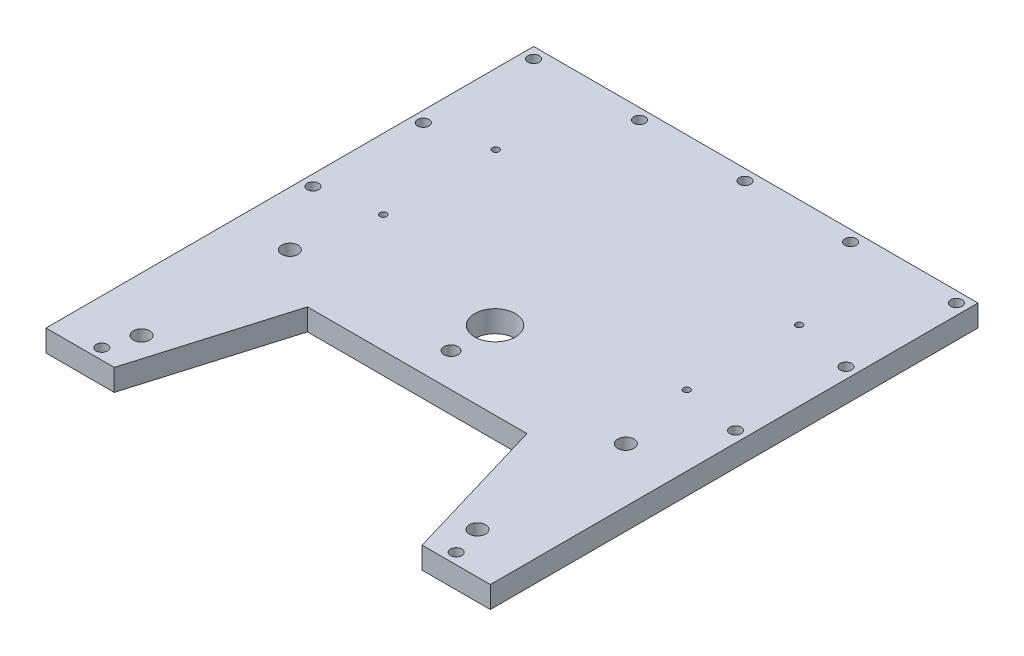
ISO-10303-21;
HEADER;
FILE_DESCRIPTION(('STEP AP214'),'2;1');
FILE_NAME('part.step','',(''),(''),'','','');
FILE_SCHEMA(('AUTOMOTIVE_DESIGN { 1 0 10303 214 1 1 1 1 }'));
ENDSEC;
DATA;
#1=APPLICATION_CONTEXT('core data for automotive mechanical design processes');
#2=APPLICATION_PROTOCOL_DEFINITION('international standard','automotive_design',2000,#1);
#3=PRODUCT_CONTEXT('',#1,'mechanical');
#4=PRODUCT('Part','Part','',(#3));
#5=PRODUCT_RELATED_PRODUCT_CATEGORY('part','',(#4));
#6=PRODUCT_DEFINITION_FORMATION('','',#4);
#7=PRODUCT_DEFINITION_CONTEXT('part definition',#1,'design');
#8=PRODUCT_DEFINITION('design','',#6,#7);
#9=PRODUCT_DEFINITION_SHAPE('','',#8);
#10=(LENGTH_UNIT() NAMED_UNIT(*) SI_UNIT(.MILLI.,.METRE.));
#11=(NAMED_UNIT(*) PLANE_ANGLE_UNIT() SI_UNIT($,.RADIAN.));
#12=(NAMED_UNIT(*) SI_UNIT($,.STERADIAN.) SOLID_ANGLE_UNIT());
#13=UNCERTAINTY_MEASURE_WITH_UNIT(LENGTH_MEASURE(1.E-05),#10,'distance_accuracy_value','');
#14=(GEOMETRIC_REPRESENTATION_CONTEXT(3) GLOBAL_UNCERTAINTY_ASSIGNED_CONTEXT((#13)) GLOBAL_UNIT_ASSIGNED_CONTEXT((#10,
#11,#12)) REPRESENTATION_CONTEXT('',''));
#15=CARTESIAN_POINT('',(0.,0.,0.));
#16=DIRECTION('',(0.,0.,1.));
#17=DIRECTION('',(1.,0.,0.));
#18=AXIS2_PLACEMENT_3D('',#15,#16,#17);
#19=CARTESIAN_POINT('',(0.,8.,0.));
#20=DIRECTION('',(0.,1.,0.));
#21=DIRECTION('',(0.,0.,1.));
#22=AXIS2_PLACEMENT_3D('',#19,#20,#21);
#23=PLANE('',#22);
#24=CARTESIAN_POINT('',(56.0000000000001,8.,-8.49999999999996));
#25=DIRECTION('',(0.,-1.,0.));
#26=DIRECTION('',(0.,0.,-1.));
#27=AXIS2_PLACEMENT_3D('',#24,#25,#26);
#28=CIRCLE('',#27,1.25000000000003);
#29=CARTESIAN_POINT('',(56.0000000000001,8.,-9.74999999999999));
#30=VERTEX_POINT('',#29);
#31=EDGE_CURVE('E230',#30,#30,#28,.T.);
#32=ORIENTED_EDGE('',*,*,#31,.T.);
#33=EDGE_LOOP('',(#32));
#34=FACE_BOUND('',#33,.T.);
#35=CARTESIAN_POINT('',(-56.0000000000001,8.,-50.));
#36=DIRECTION('',(0.,-1.,0.));
#37=DIRECTION('',(0.,0.,-1.));
#38=AXIS2_PLACEMENT_3D('',#35,#36,#37);
#39=CIRCLE('',#38,1.25);
#40=CARTESIAN_POINT('',(-56.0000000000001,8.,-51.25));
#41=VERTEX_POINT('',#40);
#42=EDGE_CURVE('E220',#41,#41,#39,.T.);
#43=ORIENTED_EDGE('',*,*,#42,.T.);
#44=EDGE_LOOP('',(#43));
#45=FACE_BOUND('',#44,.T.);
#46=CARTESIAN_POINT('',(-62.,8.,19.99));
#47=DIRECTION('',(0.,-1.,0.));
#48=DIRECTION('',(0.,0.,-1.));
#49=AXIS2_PLACEMENT_3D('',#46,#47,#48);
#50=CIRCLE('',#49,3.);
#51=CARTESIAN_POINT('',(-62.,8.,16.99));
#52=VERTEX_POINT('',#51);
#53=EDGE_CURVE('E194',#52,#52,#50,.T.);
#54=ORIENTED_EDGE('',*,*,#53,.T.);
#55=EDGE_LOOP('',(#54));
#56=FACE_BOUND('',#55,.T.);
#57=CARTESIAN_POINT('',(-62.,8.,74.7499999999999));
#58=DIRECTION('',(0.,-1.,0.));
#59=DIRECTION('',(0.,0.,-1.));
#60=AXIS2_PLACEMENT_3D('',#57,#58,#59);
#61=CIRCLE('',#60,3.);
#62=CARTESIAN_POINT('',(-62.,8.,71.7499999999999));
#63=VERTEX_POINT('',#62);
#64=EDGE_CURVE('E182',#63,#63,#61,.T.);
#65=ORIENTED_EDGE('',*,*,#64,.T.);
#66=EDGE_LOOP('',(#65));
#67=FACE_BOUND('',#66,.T.);
#68=CARTESIAN_POINT('',(65.4099999999999,8.,85.9999999999999));
#69=DIRECTION('',(0.,-1.,0.));
#70=DIRECTION('',(0.,0.,-1.));
#71=AXIS2_PLACEMENT_3D('',#68,#69,#70);
#72=CIRCLE('',#71,2.1);
#73=CARTESIAN_POINT('',(65.4099999999999,8.,83.8999999999999));
#74=VERTEX_POINT('',#73);
#75=EDGE_CURVE('E154',#74,#74,#72,.T.);
#76=ORIENTED_EDGE('',*,*,#75,.T.);
#77=EDGE_LOOP('',(#76));
#78=FACE_BOUND('',#77,.T.);
#79=DIRECTION('',(-1.,0.,0.));
#80=VECTOR('',#79,1.);
#81=CARTESIAN_POINT('',(0.,8.,35.));
#82=LINE('',#81,#80);
#83=CARTESIAN_POINT('',(40.5,8.,35.));
#84=VERTEX_POINT('',#83);
#85=CARTESIAN_POINT('',(-40.5,8.,35.));
#86=VERTEX_POINT('',#85);
#87=EDGE_CURVE('E145',#84,#86,#82,.T.);
#88=ORIENTED_EDGE('',*,*,#87,.F.);
#89=DIRECTION('',(-0.284414731086838,0.,-0.958701340742153));
#90=VECTOR('',#89,1.);
#91=CARTESIAN_POINT('',(27.6804771193105,8.,-8.21187487872877));
#92=LINE('',#91,#90);
#93=CARTESIAN_POINT('',(56.8166666666666,8.,89.9999999999999));
#94=VERTEX_POINT('',#93);
#95=EDGE_CURVE('E139',#94,#84,#92,.T.);
#96=ORIENTED_EDGE('',*,*,#95,.F.);
#97=DIRECTION('',(1.,0.,0.));
#98=VECTOR('',#97,1.);
#99=CARTESIAN_POINT('',(0.,8.,89.9999999999999));
#100=LINE('',#99,#98);
#101=CARTESIAN_POINT('',(82.,8.,89.9999999999999));
#102=VERTEX_POINT('',#101);
#103=EDGE_CURVE('E134',#94,#102,#100,.T.);
#104=ORIENTED_EDGE('',*,*,#103,.T.);
#105=DIRECTION('',(0.,0.,1.));
#106=VECTOR('',#105,1.);
#107=CARTESIAN_POINT('',(82.,8.,0.));
#108=LINE('',#107,#106);
#109=CARTESIAN_POINT('',(82.,8.,-90.0000000000001));
#110=VERTEX_POINT('',#109);
#111=EDGE_CURVE('E138',#110,#102,#108,.T.);
#112=ORIENTED_EDGE('',*,*,#111,.F.);
#113=DIRECTION('',(1.,0.,0.));
#114=VECTOR('',#113,1.);
#115=CARTESIAN_POINT('',(0.,8.,-90.0000000000001));
#116=LINE('',#115,#114);
#117=CARTESIAN_POINT('',(-82.,8.,-90.0000000000001));
#118=VERTEX_POINT('',#117);
#119=EDGE_CURVE('E119',#118,#110,#116,.T.);
#120=ORIENTED_EDGE('',*,*,#119,.F.);
#121=DIRECTION('',(0.,0.,1.));
#122=VECTOR('',#121,1.);
#123=CARTESIAN_POINT('',(-82.,8.,0.));
#124=LINE('',#123,#122);
#125=CARTESIAN_POINT('',(-82.,8.,89.9999999999999));
#126=VERTEX_POINT('',#125);
#127=EDGE_CURVE('E111',#118,#126,#124,.T.);
#128=ORIENTED_EDGE('',*,*,#127,.T.);
#129=CARTESIAN_POINT('',(-56.8166666666667,8.,89.9999999999999));
#130=VERTEX_POINT('',#129);
#131=EDGE_CURVE('E116',#126,#130,#100,.T.);
#132=ORIENTED_EDGE('',*,*,#131,.T.);
#133=DIRECTION('',(-0.284414731086839,0.,0.958701340742153));
#134=VECTOR('',#133,1.);
#135=CARTESIAN_POINT('',(-27.6804771193105,8.,-8.21187487872878));
#136=LINE('',#135,#134);
#137=EDGE_CURVE('E132',#86,#130,#136,.T.);
#138=ORIENTED_EDGE('',*,*,#137,.F.);
#139=EDGE_LOOP('',(#88,#96,#104,#112,#120,#128,#132,#138));
#140=FACE_BOUND('',#139,.T.);
#141=CARTESIAN_POINT('',(-78.,8.,-86.));
#142=DIRECTION('',(0.,1.,0.));
#143=DIRECTION('',(0.,0.,1.));
#144=AXIS2_PLACEMENT_3D('',#141,#142,#143);
#145=CIRCLE('',#144,2.1);
#146=CARTESIAN_POINT('',(-78.,8.,-83.9));
#147=VERTEX_POINT('',#146);
#148=EDGE_CURVE('E150',#147,#147,#145,.T.);
#149=ORIENTED_EDGE('',*,*,#148,.F.);
#150=EDGE_LOOP('',(#149));
#151=FACE_BOUND('',#150,.T.);
#152=CARTESIAN_POINT('',(-65.41,8.,85.9999999999999));
#153=DIRECTION('',(0.,1.,0.));
#154=DIRECTION('',(0.,0.,1.));
#155=AXIS2_PLACEMENT_3D('',#152,#153,#154);
#156=CIRCLE('',#155,2.1);
#157=CARTESIAN_POINT('',(-65.41,8.,88.0999999999999));
#158=VERTEX_POINT('',#157);
#159=EDGE_CURVE('E179',#158,#158,#156,.T.);
#160=ORIENTED_EDGE('',*,*,#159,.F.);
#161=EDGE_LOOP('',(#160));
#162=FACE_BOUND('',#161,.T.);
#163=CARTESIAN_POINT('',(78.,8.,-4.50000000000008));
#164=DIRECTION('',(0.,-1.,0.));
#165=DIRECTION('',(0.,0.,-1.));
#166=AXIS2_PLACEMENT_3D('',#163,#164,#165);
#167=CIRCLE('',#166,2.1);
#168=CARTESIAN_POINT('',(78.,8.,-6.60000000000008));
#169=VERTEX_POINT('',#168);
#170=EDGE_CURVE('E171',#169,#169,#167,.T.);
#171=ORIENTED_EDGE('',*,*,#170,.T.);
#172=EDGE_LOOP('',(#171));
#173=FACE_BOUND('',#172,.T.);
#174=CARTESIAN_POINT('',(78.,8.,-86.0000000000006));
#175=DIRECTION('',(0.,1.,0.));
#176=DIRECTION('',(0.,0.,1.));
#177=AXIS2_PLACEMENT_3D('',#174,#175,#176);
#178=CIRCLE('',#177,2.1);
#179=CARTESIAN_POINT('',(78.,8.,-83.9000000000006));
#180=VERTEX_POINT('',#179);
#181=EDGE_CURVE('E162',#180,#180,#178,.T.);
#182=ORIENTED_EDGE('',*,*,#181,.F.);
#183=EDGE_LOOP('',(#182));
#184=FACE_BOUND('',#183,.T.);
#185=CARTESIAN_POINT('',(39.,8.,-86.0000000000005));
#186=DIRECTION('',(0.,1.,0.));
#187=DIRECTION('',(0.,0.,1.));
#188=AXIS2_PLACEMENT_3D('',#185,#186,#187);
#189=CIRCLE('',#188,2.1);
#190=CARTESIAN_POINT('',(39.,8.,-83.9000000000004));
#191=VERTEX_POINT('',#190);
#192=EDGE_CURVE('E158',#191,#191,#189,.T.);
#193=ORIENTED_EDGE('',*,*,#192,.F.);
#194=EDGE_LOOP('',(#193));
#195=FACE_BOUND('',#194,.T.);
#196=CARTESIAN_POINT('',(-78.,8.,-45.25));
#197=DIRECTION('',(0.,1.,0.));
#198=DIRECTION('',(0.,0.,1.));
#199=AXIS2_PLACEMENT_3D('',#196,#197,#198);
#200=CIRCLE('',#199,2.09999999999999);
#201=CARTESIAN_POINT('',(-78.,8.,-43.15));
#202=VERTEX_POINT('',#201);
#203=EDGE_CURVE('E155',#202,#202,#200,.T.);
#204=ORIENTED_EDGE('',*,*,#203,.F.);
#205=EDGE_LOOP('',(#204));
#206=FACE_BOUND('',#205,.T.);
#207=CARTESIAN_POINT('',(-39.,8.,-86.0000000000002));
#208=DIRECTION('',(0.,1.,0.));
#209=DIRECTION('',(0.,0.,1.));
#210=AXIS2_PLACEMENT_3D('',#207,#208,#209);
#211=CIRCLE('',#210,2.1);
#212=CARTESIAN_POINT('',(-39.,8.,-83.9000000000002));
#213=VERTEX_POINT('',#212);
#214=EDGE_CURVE('E159',#213,#213,#211,.T.);
#215=ORIENTED_EDGE('',*,*,#214,.F.);
#216=EDGE_LOOP('',(#215));
#217=FACE_BOUND('',#216,.T.);
#218=CARTESIAN_POINT('',(0.,8.,-86.0000000000003));
#219=DIRECTION('',(0.,1.,0.));
#220=DIRECTION('',(0.,0.,1.));
#221=AXIS2_PLACEMENT_3D('',#218,#219,#220);
#222=CIRCLE('',#221,2.1);
#223=CARTESIAN_POINT('',(0.,8.,-83.9000000000003));
#224=VERTEX_POINT('',#223);
#225=EDGE_CURVE('E174',#224,#224,#222,.T.);
#226=ORIENTED_EDGE('',*,*,#225,.F.);
#227=EDGE_LOOP('',(#226));
#228=FACE_BOUND('',#227,.T.);
#229=CARTESIAN_POINT('',(-78.,8.,-4.50000000000005));
#230=DIRECTION('',(0.,1.,0.));
#231=DIRECTION('',(0.,0.,1.));
#232=AXIS2_PLACEMENT_3D('',#229,#230,#231);
#233=CIRCLE('',#232,2.1);
#234=CARTESIAN_POINT('',(-78.,8.,-2.40000000000005));
#235=VERTEX_POINT('',#234);
#236=EDGE_CURVE('E170',#235,#235,#233,.T.);
#237=ORIENTED_EDGE('',*,*,#236,.F.);
#238=EDGE_LOOP('',(#237));
#239=FACE_BOUND('',#238,.T.);
#240=CARTESIAN_POINT('',(78.,8.,-45.2500000000001));
#241=DIRECTION('',(0.,-1.,0.));
#242=DIRECTION('',(0.,0.,-1.));
#243=AXIS2_PLACEMENT_3D('',#240,#241,#242);
#244=CIRCLE('',#243,2.09999999999999);
#245=CARTESIAN_POINT('',(78.,8.,-47.3500000000001));
#246=VERTEX_POINT('',#245);
#247=EDGE_CURVE('E167',#246,#246,#244,.T.);
#248=ORIENTED_EDGE('',*,*,#247,.T.);
#249=EDGE_LOOP('',(#248));
#250=FACE_BOUND('',#249,.T.);
#251=CARTESIAN_POINT('',(0.,8.,22.5));
#252=DIRECTION('',(0.,1.,0.));
#253=DIRECTION('',(0.,0.,1.));
#254=AXIS2_PLACEMENT_3D('',#251,#252,#253);
#255=CIRCLE('',#254,2.6);
#256=CARTESIAN_POINT('',(0.,8.,25.1));
#257=VERTEX_POINT('',#256);
#258=EDGE_CURVE('E210',#257,#257,#255,.T.);
#259=ORIENTED_EDGE('',*,*,#258,.F.);
#260=EDGE_LOOP('',(#259));
#261=FACE_BOUND('',#260,.T.);
#262=CARTESIAN_POINT('',(62.,8.,74.7499999999999));
#263=DIRECTION('',(0.,1.,0.));
#264=DIRECTION('',(0.,0.,1.));
#265=AXIS2_PLACEMENT_3D('',#262,#263,#264);
#266=CIRCLE('',#265,3.00000000000001);
#267=CARTESIAN_POINT('',(62.,8.,77.7499999999999));
#268=VERTEX_POINT('',#267);
#269=EDGE_CURVE('E191',#268,#268,#266,.T.);
#270=ORIENTED_EDGE('',*,*,#269,.F.);
#271=EDGE_LOOP('',(#270));
#272=FACE_BOUND('',#271,.T.);
#273=CARTESIAN_POINT('',(62.,8.,19.9899999999999));
#274=DIRECTION('',(0.,1.,0.));
#275=DIRECTION('',(0.,0.,1.));
#276=AXIS2_PLACEMENT_3D('',#273,#274,#275);
#277=CIRCLE('',#276,3.00000000000001);
#278=CARTESIAN_POINT('',(62.,8.,22.99));
#279=VERTEX_POINT('',#278);
#280=EDGE_CURVE('E198',#279,#279,#277,.T.);
#281=ORIENTED_EDGE('',*,*,#280,.F.);
#282=EDGE_LOOP('',(#281));
#283=FACE_BOUND('',#282,.T.);
#284=CARTESIAN_POINT('',(0.,8.,6.24999999999995));
#285=DIRECTION('',(0.,1.,0.));
#286=DIRECTION('',(0.,0.,1.));
#287=AXIS2_PLACEMENT_3D('',#284,#285,#286);
#288=CIRCLE('',#287,7.5);
#289=CARTESIAN_POINT('',(0.,8.,13.75));
#290=VERTEX_POINT('',#289);
#291=EDGE_CURVE('E203',#290,#290,#288,.T.);
#292=ORIENTED_EDGE('',*,*,#291,.F.);
#293=EDGE_LOOP('',(#292));
#294=FACE_BOUND('',#293,.T.);
#295=CARTESIAN_POINT('',(-56.0000000000001,8.,-8.49999999999995));
#296=DIRECTION('',(0.,1.,0.));
#297=DIRECTION('',(0.,0.,1.));
#298=AXIS2_PLACEMENT_3D('',#295,#296,#297);
#299=CIRCLE('',#298,1.25000000000006);
#300=CARTESIAN_POINT('',(-56.0000000000001,8.,-7.24999999999989));
#301=VERTEX_POINT('',#300);
#302=EDGE_CURVE('E224',#301,#301,#299,.T.);
#303=ORIENTED_EDGE('',*,*,#302,.F.);
#304=EDGE_LOOP('',(#303));
#305=FACE_BOUND('',#304,.T.);
#306=CARTESIAN_POINT('',(56.0000000000001,8.,-50.0000000000001));
#307=DIRECTION('',(0.,1.,0.));
#308=DIRECTION('',(0.,0.,1.));
#309=AXIS2_PLACEMENT_3D('',#306,#307,#308);
#310=CIRCLE('',#309,1.25);
#311=CARTESIAN_POINT('',(56.0000000000001,8.,-48.7500000000001));
#312=VERTEX_POINT('',#311);
#313=EDGE_CURVE('E227',#312,#312,#310,.T.);
#314=ORIENTED_EDGE('',*,*,#313,.F.);
#315=EDGE_LOOP('',(#314));
#316=FACE_BOUND('',#315,.T.);
#317=ADVANCED_FACE('F41',(#34,#45,#56,#67,#78,#140,#151,#162,#173,#184,#195,#206,#217,#228,#239,
#250,#261,#272,#283,#294,#305,#316),#23,.T.);
#318=CARTESIAN_POINT('',(0.,0.,0.));
#319=DIRECTION('',(0.,1.,0.));
#320=DIRECTION('',(0.,0.,1.));
#321=AXIS2_PLACEMENT_3D('',#318,#319,#320);
#322=PLANE('',#321);
#323=CARTESIAN_POINT('',(-56.0000000000001,0.,-8.49999999999995));
#324=DIRECTION('',(0.,1.,0.));
#325=DIRECTION('',(0.,0.,1.));
#326=AXIS2_PLACEMENT_3D('',#323,#324,#325);
#327=CIRCLE('',#326,1.25000000000006);
#328=CARTESIAN_POINT('',(-56.0000000000001,0.,-7.24999999999989));
#329=VERTEX_POINT('',#328);
#330=EDGE_CURVE('E239',#329,#329,#327,.F.);
#331=ORIENTED_EDGE('',*,*,#330,.F.);
#332=EDGE_LOOP('',(#331));
#333=FACE_BOUND('',#332,.T.);
#334=CARTESIAN_POINT('',(-56.0000000000001,0.,-50.));
#335=DIRECTION('',(0.,1.,0.));
#336=DIRECTION('',(0.,0.,1.));
#337=AXIS2_PLACEMENT_3D('',#334,#335,#336);
#338=CIRCLE('',#337,1.25);
#339=CARTESIAN_POINT('',(-56.0000000000001,0.,-48.75));
#340=VERTEX_POINT('',#339);
#341=EDGE_CURVE('E221',#340,#340,#338,.T.);
#342=ORIENTED_EDGE('',*,*,#341,.T.);
#343=EDGE_LOOP('',(#342));
#344=FACE_BOUND('',#343,.T.);
#345=CARTESIAN_POINT('',(62.,0.,19.9899999999999));
#346=DIRECTION('',(0.,1.,0.));
#347=DIRECTION('',(0.,0.,1.));
#348=AXIS2_PLACEMENT_3D('',#345,#346,#347);
#349=CIRCLE('',#348,3.00000000000001);
#350=CARTESIAN_POINT('',(62.,0.,22.99));
#351=VERTEX_POINT('',#350);
#352=EDGE_CURVE('E206',#351,#351,#349,.F.);
#353=ORIENTED_EDGE('',*,*,#352,.F.);
#354=EDGE_LOOP('',(#353));
#355=FACE_BOUND('',#354,.T.);
#356=CARTESIAN_POINT('',(0.,0.,22.5));
#357=DIRECTION('',(0.,1.,0.));
#358=DIRECTION('',(0.,0.,1.));
#359=AXIS2_PLACEMENT_3D('',#356,#357,#358);
#360=CIRCLE('',#359,2.6);
#361=CARTESIAN_POINT('',(0.,0.,25.1));
#362=VERTEX_POINT('',#361);
#363=EDGE_CURVE('E217',#362,#362,#360,.F.);
#364=ORIENTED_EDGE('',*,*,#363,.F.);
#365=EDGE_LOOP('',(#364));
#366=FACE_BOUND('',#365,.T.);
#367=CARTESIAN_POINT('',(-62.,0.,74.7499999999999));
#368=DIRECTION('',(0.,1.,0.));
#369=DIRECTION('',(0.,0.,1.));
#370=AXIS2_PLACEMENT_3D('',#367,#368,#369);
#371=CIRCLE('',#370,3.);
#372=CARTESIAN_POINT('',(-62.,0.,77.7499999999999));
#373=VERTEX_POINT('',#372);
#374=EDGE_CURVE('E185',#373,#373,#371,.T.);
#375=ORIENTED_EDGE('',*,*,#374,.T.);
#376=EDGE_LOOP('',(#375));
#377=FACE_BOUND('',#376,.T.);
#378=CARTESIAN_POINT('',(-78.,0.,-4.50000000000005));
#379=DIRECTION('',(0.,1.,0.));
#380=DIRECTION('',(0.,0.,1.));
#381=AXIS2_PLACEMENT_3D('',#378,#379,#380);
#382=CIRCLE('',#381,2.1);
#383=CARTESIAN_POINT('',(-78.,0.,-2.40000000000005));
#384=VERTEX_POINT('',#383);
#385=EDGE_CURVE('E262',#384,#384,#382,.T.);
#386=ORIENTED_EDGE('',*,*,#385,.T.);
#387=EDGE_LOOP('',(#386));
#388=FACE_BOUND('',#387,.T.);
#389=CARTESIAN_POINT('',(0.,0.,-86.0000000000003));
#390=DIRECTION('',(0.,1.,0.));
#391=DIRECTION('',(0.,0.,1.));
#392=AXIS2_PLACEMENT_3D('',#389,#390,#391);
#393=CIRCLE('',#392,2.1);
#394=CARTESIAN_POINT('',(0.,0.,-83.9000000000003));
#395=VERTEX_POINT('',#394);
#396=EDGE_CURVE('E266',#395,#395,#393,.T.);
#397=ORIENTED_EDGE('',*,*,#396,.T.);
#398=EDGE_LOOP('',(#397));
#399=FACE_BOUND('',#398,.T.);
#400=CARTESIAN_POINT('',(-39.,0.,-86.0000000000002));
#401=DIRECTION('',(0.,1.,0.));
#402=DIRECTION('',(0.,0.,1.));
#403=AXIS2_PLACEMENT_3D('',#400,#401,#402);
#404=CIRCLE('',#403,2.1);
#405=CARTESIAN_POINT('',(-39.,0.,-83.9000000000002));
#406=VERTEX_POINT('',#405);
#407=EDGE_CURVE('E270',#406,#406,#404,.T.);
#408=ORIENTED_EDGE('',*,*,#407,.T.);
#409=EDGE_LOOP('',(#408));
#410=FACE_BOUND('',#409,.T.);
#411=CARTESIAN_POINT('',(-78.,0.,-45.25));
#412=DIRECTION('',(0.,1.,0.));
#413=DIRECTION('',(0.,0.,1.));
#414=AXIS2_PLACEMENT_3D('',#411,#412,#413);
#415=CIRCLE('',#414,2.09999999999999);
#416=CARTESIAN_POINT('',(-78.,0.,-43.15));
#417=VERTEX_POINT('',#416);
#418=EDGE_CURVE('E274',#417,#417,#415,.T.);
#419=ORIENTED_EDGE('',*,*,#418,.T.);
#420=EDGE_LOOP('',(#419));
#421=FACE_BOUND('',#420,.T.);
#422=CARTESIAN_POINT('',(39.,0.,-86.0000000000005));
#423=DIRECTION('',(0.,1.,0.));
#424=DIRECTION('',(0.,0.,1.));
#425=AXIS2_PLACEMENT_3D('',#422,#423,#424);
#426=CIRCLE('',#425,2.1);
#427=CARTESIAN_POINT('',(39.,0.,-83.9000000000004));
#428=VERTEX_POINT('',#427);
#429=EDGE_CURVE('E278',#428,#428,#426,.T.);
#430=ORIENTED_EDGE('',*,*,#429,.T.);
#431=EDGE_LOOP('',(#430));
#432=FACE_BOUND('',#431,.T.);
#433=CARTESIAN_POINT('',(78.,0.,-86.0000000000006));
#434=DIRECTION('',(0.,1.,0.));
#435=DIRECTION('',(0.,0.,1.));
#436=AXIS2_PLACEMENT_3D('',#433,#434,#435);
#437=CIRCLE('',#436,2.1);
#438=CARTESIAN_POINT('',(78.,0.,-83.9000000000006));
#439=VERTEX_POINT('',#438);
#440=EDGE_CURVE('E282',#439,#439,#437,.T.);
#441=ORIENTED_EDGE('',*,*,#440,.T.);
#442=EDGE_LOOP('',(#441));
#443=FACE_BOUND('',#442,.T.);
#444=CARTESIAN_POINT('',(-65.41,0.,85.9999999999999));
#445=DIRECTION('',(0.,1.,0.));
#446=DIRECTION('',(0.,0.,1.));
#447=AXIS2_PLACEMENT_3D('',#444,#445,#446);
#448=CIRCLE('',#447,2.1);
#449=CARTESIAN_POINT('',(-65.41,0.,88.0999999999999));
#450=VERTEX_POINT('',#449);
#451=EDGE_CURVE('E286',#450,#450,#448,.T.);
#452=ORIENTED_EDGE('',*,*,#451,.T.);
#453=EDGE_LOOP('',(#452));
#454=FACE_BOUND('',#453,.T.);
#455=CARTESIAN_POINT('',(-78.,0.,-86.));
#456=DIRECTION('',(0.,1.,0.));
#457=DIRECTION('',(0.,0.,1.));
#458=AXIS2_PLACEMENT_3D('',#455,#456,#457);
#459=CIRCLE('',#458,2.1);
#460=CARTESIAN_POINT('',(-78.,0.,-83.9));
#461=VERTEX_POINT('',#460);
#462=EDGE_CURVE('E153',#461,#461,#459,.T.);
#463=ORIENTED_EDGE('',*,*,#462,.T.);
#464=EDGE_LOOP('',(#463));
#465=FACE_BOUND('',#464,.T.);
#466=DIRECTION('',(-1.,0.,0.));
#467=VECTOR('',#466,1.);
#468=CARTESIAN_POINT('',(0.,0.,35.));
#469=LINE('',#468,#467);
#470=CARTESIAN_POINT('',(40.5,0.,35.));
#471=VERTEX_POINT('',#470);
#472=CARTESIAN_POINT('',(-40.5,0.,35.));
#473=VERTEX_POINT('',#472);
#474=EDGE_CURVE('E293',#471,#473,#469,.T.);
#475=ORIENTED_EDGE('',*,*,#474,.T.);
#476=DIRECTION('',(-0.284414731086839,0.,0.958701340742153));
#477=VECTOR('',#476,1.);
#478=CARTESIAN_POINT('',(-27.6804771193105,0.,-8.21187487872878));
#479=LINE('',#478,#477);
#480=CARTESIAN_POINT('',(-56.8166666666667,0.,89.9999999999999));
#481=VERTEX_POINT('',#480);
#482=EDGE_CURVE('E147',#473,#481,#479,.T.);
#483=ORIENTED_EDGE('',*,*,#482,.T.);
#484=DIRECTION('',(1.,0.,0.));
#485=VECTOR('',#484,1.);
#486=CARTESIAN_POINT('',(0.,0.,89.9999999999999));
#487=LINE('',#486,#485);
#488=CARTESIAN_POINT('',(-82.,0.,89.9999999999999));
#489=VERTEX_POINT('',#488);
#490=EDGE_CURVE('E366',#489,#481,#487,.T.);
#491=ORIENTED_EDGE('',*,*,#490,.F.);
#492=DIRECTION('',(0.,0.,1.));
#493=VECTOR('',#492,1.);
#494=CARTESIAN_POINT('',(-82.,0.,0.));
#495=LINE('',#494,#493);
#496=CARTESIAN_POINT('',(-82.,0.,-90.0000000000001));
#497=VERTEX_POINT('',#496);
#498=EDGE_CURVE('E126',#497,#489,#495,.T.);
#499=ORIENTED_EDGE('',*,*,#498,.F.);
#500=DIRECTION('',(1.,0.,0.));
#501=VECTOR('',#500,1.);
#502=CARTESIAN_POINT('',(0.,0.,-90.0000000000001));
#503=LINE('',#502,#501);
#504=CARTESIAN_POINT('',(82.,0.,-90.0000000000001));
#505=VERTEX_POINT('',#504);
#506=EDGE_CURVE('E371',#497,#505,#503,.T.);
#507=ORIENTED_EDGE('',*,*,#506,.T.);
#508=DIRECTION('',(0.,0.,1.));
#509=VECTOR('',#508,1.);
#510=CARTESIAN_POINT('',(82.,0.,0.));
#511=LINE('',#510,#509);
#512=CARTESIAN_POINT('',(82.,0.,89.9999999999999));
#513=VERTEX_POINT('',#512);
#514=EDGE_CURVE('E364',#505,#513,#511,.T.);
#515=ORIENTED_EDGE('',*,*,#514,.T.);
#516=CARTESIAN_POINT('',(56.8166666666666,0.,89.9999999999999));
#517=VERTEX_POINT('',#516);
#518=EDGE_CURVE('E361',#517,#513,#487,.T.);
#519=ORIENTED_EDGE('',*,*,#518,.F.);
#520=DIRECTION('',(-0.284414731086838,0.,-0.958701340742153));
#521=VECTOR('',#520,1.);
#522=CARTESIAN_POINT('',(27.6804771193105,0.,-8.21187487872877));
#523=LINE('',#522,#521);
#524=EDGE_CURVE('E359',#517,#471,#523,.T.);
#525=ORIENTED_EDGE('',*,*,#524,.T.);
#526=EDGE_LOOP('',(#475,#483,#491,#499,#507,#515,#519,#525));
#527=FACE_BOUND('',#526,.T.);
#528=CARTESIAN_POINT('',(78.,0.,-4.50000000000008));
#529=DIRECTION('',(0.,1.,0.));
#530=DIRECTION('',(0.,0.,1.));
#531=AXIS2_PLACEMENT_3D('',#528,#529,#530);
#532=CIRCLE('',#531,2.1);
#533=CARTESIAN_POINT('',(78.,0.,-2.40000000000008));
#534=VERTEX_POINT('',#533);
#535=EDGE_CURVE('E297',#534,#534,#532,.F.);
#536=ORIENTED_EDGE('',*,*,#535,.F.);
#537=EDGE_LOOP('',(#536));
#538=FACE_BOUND('',#537,.T.);
#539=CARTESIAN_POINT('',(65.4099999999999,0.,85.9999999999999));
#540=DIRECTION('',(0.,1.,0.));
#541=DIRECTION('',(0.,0.,1.));
#542=AXIS2_PLACEMENT_3D('',#539,#540,#541);
#543=CIRCLE('',#542,2.1);
#544=CARTESIAN_POINT('',(65.4099999999999,0.,88.0999999999999));
#545=VERTEX_POINT('',#544);
#546=EDGE_CURVE('E301',#545,#545,#543,.F.);
#547=ORIENTED_EDGE('',*,*,#546,.F.);
#548=EDGE_LOOP('',(#547));
#549=FACE_BOUND('',#548,.T.);
#550=CARTESIAN_POINT('',(78.,0.,-45.2500000000001));
#551=DIRECTION('',(0.,1.,0.));
#552=DIRECTION('',(0.,0.,1.));
#553=AXIS2_PLACEMENT_3D('',#550,#551,#552);
#554=CIRCLE('',#553,2.09999999999999);
#555=CARTESIAN_POINT('',(78.,0.,-43.1500000000001));
#556=VERTEX_POINT('',#555);
#557=EDGE_CURVE('E45',#556,#556,#554,.F.);
#558=ORIENTED_EDGE('',*,*,#557,.F.);
#559=EDGE_LOOP('',(#558));
#560=FACE_BOUND('',#559,.T.);
#561=CARTESIAN_POINT('',(-62.,0.,19.99));
#562=DIRECTION('',(0.,1.,0.));
#563=DIRECTION('',(0.,0.,1.));
#564=AXIS2_PLACEMENT_3D('',#561,#562,#563);
#565=CIRCLE('',#564,3.);
#566=CARTESIAN_POINT('',(-62.,0.,22.99));
#567=VERTEX_POINT('',#566);
#568=EDGE_CURVE('E188',#567,#567,#565,.T.);
#569=ORIENTED_EDGE('',*,*,#568,.T.);
#570=EDGE_LOOP('',(#569));
#571=FACE_BOUND('',#570,.T.);
#572=CARTESIAN_POINT('',(62.,0.,74.7499999999999));
#573=DIRECTION('',(0.,1.,0.));
#574=DIRECTION('',(0.,0.,1.));
#575=AXIS2_PLACEMENT_3D('',#572,#573,#574);
#576=CIRCLE('',#575,3.00000000000001);
#577=CARTESIAN_POINT('',(62.,0.,77.7499999999999));
#578=VERTEX_POINT('',#577);
#579=EDGE_CURVE('E195',#578,#578,#576,.F.);
#580=ORIENTED_EDGE('',*,*,#579,.F.);
#581=EDGE_LOOP('',(#580));
#582=FACE_BOUND('',#581,.T.);
#583=CARTESIAN_POINT('',(0.,0.,6.24999999999995));
#584=DIRECTION('',(0.,1.,0.));
#585=DIRECTION('',(0.,0.,1.));
#586=AXIS2_PLACEMENT_3D('',#583,#584,#585);
#587=CIRCLE('',#586,7.5);
#588=CARTESIAN_POINT('',(0.,0.,13.75));
#589=VERTEX_POINT('',#588);
#590=EDGE_CURVE('E207',#589,#589,#587,.F.);
#591=ORIENTED_EDGE('',*,*,#590,.F.);
#592=EDGE_LOOP('',(#591));
#593=FACE_BOUND('',#592,.T.);
#594=CARTESIAN_POINT('',(56.0000000000001,0.,-8.49999999999996));
#595=DIRECTION('',(0.,1.,0.));
#596=DIRECTION('',(0.,0.,1.));
#597=AXIS2_PLACEMENT_3D('',#594,#595,#596);
#598=CIRCLE('',#597,1.25000000000003);
#599=CARTESIAN_POINT('',(56.0000000000001,0.,-7.24999999999994));
#600=VERTEX_POINT('',#599);
#601=EDGE_CURVE('E236',#600,#600,#598,.T.);
#602=ORIENTED_EDGE('',*,*,#601,.T.);
#603=EDGE_LOOP('',(#602));
#604=FACE_BOUND('',#603,.T.);
#605=CARTESIAN_POINT('',(56.0000000000001,0.,-50.0000000000001));
#606=DIRECTION('',(0.,1.,0.));
#607=DIRECTION('',(0.,0.,1.));
#608=AXIS2_PLACEMENT_3D('',#605,#606,#607);
#609=CIRCLE('',#608,1.25);
#610=CARTESIAN_POINT('',(56.0000000000001,0.,-48.7500000000001));
#611=VERTEX_POINT('',#610);
#612=EDGE_CURVE('E231',#611,#611,#609,.F.);
#613=ORIENTED_EDGE('',*,*,#612,.F.);
#614=EDGE_LOOP('',(#613));
#615=FACE_BOUND('',#614,.T.);
#616=ADVANCED_FACE('F247',(#333,#344,#355,#366,#377,#388,#399,#410,#421,#432,#443,#454,#465,
#527,#538,#549,#560,#571,#582,#593,#604,#615),#322,.F.);
#617=CARTESIAN_POINT('',(0.,8.,35.));
#618=DIRECTION('',(0.,0.,1.));
#619=DIRECTION('',(1.,0.,0.));
#620=AXIS2_PLACEMENT_3D('',#617,#618,#619);
#621=PLANE('',#620);
#622=ORIENTED_EDGE('',*,*,#474,.F.);
#623=DIRECTION('',(0.,-1.,0.));
#624=VECTOR('',#623,1.);
#625=CARTESIAN_POINT('',(40.5,8.,35.));
#626=LINE('',#625,#624);
#627=EDGE_CURVE('E11',#84,#471,#626,.T.);
#628=ORIENTED_EDGE('',*,*,#627,.F.);
#629=ORIENTED_EDGE('',*,*,#87,.T.);
#630=DIRECTION('',(0.,-1.,0.));
#631=VECTOR('',#630,1.);
#632=CARTESIAN_POINT('',(-40.5,8.,35.));
#633=LINE('',#632,#631);
#634=EDGE_CURVE('E60',#86,#473,#633,.T.);
#635=ORIENTED_EDGE('',*,*,#634,.T.);
#636=EDGE_LOOP('',(#622,#628,#629,#635));
#637=FACE_BOUND('',#636,.T.);
#638=ADVANCED_FACE('F43',(#637),#621,.T.);
#639=CARTESIAN_POINT('',(27.6804771193105,8.,-8.21187487872877));
#640=DIRECTION('',(-0.958701340742153,0.,0.284414731086838));
#641=DIRECTION('',(0.284414731086838,0.,0.958701340742153));
#642=AXIS2_PLACEMENT_3D('',#639,#640,#641);
#643=PLANE('',#642);
#644=ORIENTED_EDGE('',*,*,#524,.F.);
#645=DIRECTION('',(0.,-1.,0.));
#646=VECTOR('',#645,1.);
#647=CARTESIAN_POINT('',(56.8166666666666,8.,89.9999999999999));
#648=LINE('',#647,#646);
#649=EDGE_CURVE('E51',#94,#517,#648,.T.);
#650=ORIENTED_EDGE('',*,*,#649,.F.);
#651=ORIENTED_EDGE('',*,*,#95,.T.);
#652=ORIENTED_EDGE('',*,*,#627,.T.);
#653=EDGE_LOOP('',(#644,#650,#651,#652));
#654=FACE_BOUND('',#653,.T.);
#655=ADVANCED_FACE('F351',(#654),#643,.T.);
#656=CARTESIAN_POINT('',(0.,8.,89.9999999999999));
#657=DIRECTION('',(0.,0.,-1.));
#658=DIRECTION('',(-1.,0.,0.));
#659=AXIS2_PLACEMENT_3D('',#656,#657,#658);
#660=PLANE('',#659);
#661=ORIENTED_EDGE('',*,*,#518,.T.);
#662=DIRECTION('',(0.,-1.,0.));
#663=VECTOR('',#662,1.);
#664=CARTESIAN_POINT('',(82.,8.,89.9999999999999));
#665=LINE('',#664,#663);
#666=EDGE_CURVE('E381',#102,#513,#665,.T.);
#667=ORIENTED_EDGE('',*,*,#666,.F.);
#668=ORIENTED_EDGE('',*,*,#103,.F.);
#669=ORIENTED_EDGE('',*,*,#649,.T.);
#670=EDGE_LOOP('',(#661,#667,#668,#669));
#671=FACE_BOUND('',#670,.T.);
#672=ADVANCED_FACE('F341',(#671),#660,.F.);
#673=CARTESIAN_POINT('',(82.,8.,0.));
#674=DIRECTION('',(1.,0.,0.));
#675=DIRECTION('',(0.,0.,-1.));
#676=AXIS2_PLACEMENT_3D('',#673,#674,#675);
#677=PLANE('',#676);
#678=ORIENTED_EDGE('',*,*,#514,.F.);
#679=DIRECTION('',(0.,-1.,0.));
#680=VECTOR('',#679,1.);
#681=CARTESIAN_POINT('',(82.,8.,-90.0000000000001));
#682=LINE('',#681,#680);
#683=EDGE_CURVE('E379',#110,#505,#682,.T.);
#684=ORIENTED_EDGE('',*,*,#683,.F.);
#685=ORIENTED_EDGE('',*,*,#111,.T.);
#686=ORIENTED_EDGE('',*,*,#666,.T.);
#687=EDGE_LOOP('',(#678,#684,#685,#686));
#688=FACE_BOUND('',#687,.T.);
#689=ADVANCED_FACE('F347',(#688),#677,.T.);
#690=CARTESIAN_POINT('',(0.,8.,-90.0000000000001));
#691=DIRECTION('',(0.,0.,-1.));
#692=DIRECTION('',(-1.,0.,0.));
#693=AXIS2_PLACEMENT_3D('',#690,#691,#692);
#694=PLANE('',#693);
#695=ORIENTED_EDGE('',*,*,#506,.F.);
#696=DIRECTION('',(0.,-1.,0.));
#697=VECTOR('',#696,1.);
#698=CARTESIAN_POINT('',(-82.,8.,-90.0000000000001));
#699=LINE('',#698,#697);
#700=EDGE_CURVE('E129',#118,#497,#699,.T.);
#701=ORIENTED_EDGE('',*,*,#700,.F.);
#702=ORIENTED_EDGE('',*,*,#119,.T.);
#703=ORIENTED_EDGE('',*,*,#683,.T.);
#704=EDGE_LOOP('',(#695,#701,#702,#703));
#705=FACE_BOUND('',#704,.T.);
#706=ADVANCED_FACE('F344',(#705),#694,.T.);
#707=CARTESIAN_POINT('',(-82.,8.,0.));
#708=DIRECTION('',(1.,0.,0.));
#709=DIRECTION('',(0.,0.,-1.));
#710=AXIS2_PLACEMENT_3D('',#707,#708,#709);
#711=PLANE('',#710);
#712=ORIENTED_EDGE('',*,*,#498,.T.);
#713=DIRECTION('',(0.,-1.,0.));
#714=VECTOR('',#713,1.);
#715=CARTESIAN_POINT('',(-82.,8.,89.9999999999999));
#716=LINE('',#715,#714);
#717=EDGE_CURVE('E123',#126,#489,#716,.T.);
#718=ORIENTED_EDGE('',*,*,#717,.F.);
#719=ORIENTED_EDGE('',*,*,#127,.F.);
#720=ORIENTED_EDGE('',*,*,#700,.T.);
#721=EDGE_LOOP('',(#712,#718,#719,#720));
#722=FACE_BOUND('',#721,.T.);
#723=ADVANCED_FACE('F124',(#722),#711,.F.);
#724=ORIENTED_EDGE('',*,*,#490,.T.);
#725=DIRECTION('',(0.,-1.,0.));
#726=VECTOR('',#725,1.);
#727=CARTESIAN_POINT('',(-56.8166666666667,8.,89.9999999999999));
#728=LINE('',#727,#726);
#729=EDGE_CURVE('E86',#130,#481,#728,.T.);
#730=ORIENTED_EDGE('',*,*,#729,.F.);
#731=ORIENTED_EDGE('',*,*,#131,.F.);
#732=ORIENTED_EDGE('',*,*,#717,.T.);
#733=EDGE_LOOP('',(#724,#730,#731,#732));
#734=FACE_BOUND('',#733,.T.);
#735=ADVANCED_FACE('F131',(#734),#660,.F.);
#736=CARTESIAN_POINT('',(-27.6804771193105,8.,-8.21187487872878));
#737=DIRECTION('',(0.958701340742153,0.,0.284414731086839));
#738=DIRECTION('',(0.284414731086839,0.,-0.958701340742153));
#739=AXIS2_PLACEMENT_3D('',#736,#737,#738);
#740=PLANE('',#739);
#741=ORIENTED_EDGE('',*,*,#482,.F.);
#742=ORIENTED_EDGE('',*,*,#634,.F.);
#743=ORIENTED_EDGE('',*,*,#137,.T.);
#744=ORIENTED_EDGE('',*,*,#729,.T.);
#745=EDGE_LOOP('',(#741,#742,#743,#744));
#746=FACE_BOUND('',#745,.T.);
#747=ADVANCED_FACE('F336',(#746),#740,.T.);
#748=CARTESIAN_POINT('',(-78.,-2.,-86.));
#749=DIRECTION('',(0.,1.,0.));
#750=DIRECTION('',(0.,0.,1.));
#751=AXIS2_PLACEMENT_3D('',#748,#749,#750);
#752=CYLINDRICAL_SURFACE('',#751,2.1);
#753=ORIENTED_EDGE('',*,*,#148,.T.);
#754=EDGE_LOOP('',(#753));
#755=FACE_BOUND('',#754,.T.);
#756=ORIENTED_EDGE('',*,*,#462,.F.);
#757=EDGE_LOOP('',(#756));
#758=FACE_BOUND('',#757,.T.);
#759=ADVANCED_FACE('F333',(#755,#758),#752,.F.);
#760=CARTESIAN_POINT('',(-65.41,-2.,85.9999999999999));
#761=DIRECTION('',(0.,1.,0.));
#762=DIRECTION('',(0.,0.,1.));
#763=AXIS2_PLACEMENT_3D('',#760,#761,#762);
#764=CYLINDRICAL_SURFACE('',#763,2.1);
#765=ORIENTED_EDGE('',*,*,#159,.T.);
#766=EDGE_LOOP('',(#765));
#767=FACE_BOUND('',#766,.T.);
#768=ORIENTED_EDGE('',*,*,#451,.F.);
#769=EDGE_LOOP('',(#768));
#770=FACE_BOUND('',#769,.T.);
#771=ADVANCED_FACE('F489',(#767,#770),#764,.F.);
#772=CARTESIAN_POINT('',(78.,-2.,-4.50000000000008));
#773=DIRECTION('',(0.,1.,0.));
#774=DIRECTION('',(0.,0.,1.));
#775=AXIS2_PLACEMENT_3D('',#772,#773,#774);
#776=CYLINDRICAL_SURFACE('',#775,2.1);
#777=ORIENTED_EDGE('',*,*,#170,.F.);
#778=EDGE_LOOP('',(#777));
#779=FACE_BOUND('',#778,.T.);
#780=ORIENTED_EDGE('',*,*,#535,.T.);
#781=EDGE_LOOP('',(#780));
#782=FACE_BOUND('',#781,.T.);
#783=ADVANCED_FACE('F416',(#779,#782),#776,.F.);
#784=CARTESIAN_POINT('',(65.4099999999999,-2.,85.9999999999999));
#785=DIRECTION('',(0.,1.,0.));
#786=DIRECTION('',(0.,0.,1.));
#787=AXIS2_PLACEMENT_3D('',#784,#785,#786);
#788=CYLINDRICAL_SURFACE('',#787,2.1);
#789=ORIENTED_EDGE('',*,*,#75,.F.);
#790=EDGE_LOOP('',(#789));
#791=FACE_BOUND('',#790,.T.);
#792=ORIENTED_EDGE('',*,*,#546,.T.);
#793=EDGE_LOOP('',(#792));
#794=FACE_BOUND('',#793,.T.);
#795=ADVANCED_FACE('F412',(#791,#794),#788,.F.);
#796=CARTESIAN_POINT('',(78.,-2.,-86.0000000000006));
#797=DIRECTION('',(0.,1.,0.));
#798=DIRECTION('',(0.,0.,1.));
#799=AXIS2_PLACEMENT_3D('',#796,#797,#798);
#800=CYLINDRICAL_SURFACE('',#799,2.1);
#801=ORIENTED_EDGE('',*,*,#181,.T.);
#802=EDGE_LOOP('',(#801));
#803=FACE_BOUND('',#802,.T.);
#804=ORIENTED_EDGE('',*,*,#440,.F.);
#805=EDGE_LOOP('',(#804));
#806=FACE_BOUND('',#805,.T.);
#807=ADVANCED_FACE('F415',(#803,#806),#800,.F.);
#808=CARTESIAN_POINT('',(39.,-2.,-86.0000000000005));
#809=DIRECTION('',(0.,1.,0.));
#810=DIRECTION('',(0.,0.,1.));
#811=AXIS2_PLACEMENT_3D('',#808,#809,#810);
#812=CYLINDRICAL_SURFACE('',#811,2.1);
#813=ORIENTED_EDGE('',*,*,#192,.T.);
#814=EDGE_LOOP('',(#813));
#815=FACE_BOUND('',#814,.T.);
#816=ORIENTED_EDGE('',*,*,#429,.F.);
#817=EDGE_LOOP('',(#816));
#818=FACE_BOUND('',#817,.T.);
#819=ADVANCED_FACE('F420',(#815,#818),#812,.F.);
#820=CARTESIAN_POINT('',(-78.,-2.,-45.25));
#821=DIRECTION('',(0.,1.,0.));
#822=DIRECTION('',(0.,0.,1.));
#823=AXIS2_PLACEMENT_3D('',#820,#821,#822);
#824=CYLINDRICAL_SURFACE('',#823,2.09999999999999);
#825=ORIENTED_EDGE('',*,*,#203,.T.);
#826=EDGE_LOOP('',(#825));
#827=FACE_BOUND('',#826,.T.);
#828=ORIENTED_EDGE('',*,*,#418,.F.);
#829=EDGE_LOOP('',(#828));
#830=FACE_BOUND('',#829,.T.);
#831=ADVANCED_FACE('F423',(#827,#830),#824,.F.);
#832=CARTESIAN_POINT('',(-39.,-2.,-86.0000000000002));
#833=DIRECTION('',(0.,1.,0.));
#834=DIRECTION('',(0.,0.,1.));
#835=AXIS2_PLACEMENT_3D('',#832,#833,#834);
#836=CYLINDRICAL_SURFACE('',#835,2.1);
#837=ORIENTED_EDGE('',*,*,#214,.T.);
#838=EDGE_LOOP('',(#837));
#839=FACE_BOUND('',#838,.T.);
#840=ORIENTED_EDGE('',*,*,#407,.F.);
#841=EDGE_LOOP('',(#840));
#842=FACE_BOUND('',#841,.T.);
#843=ADVANCED_FACE('F426',(#839,#842),#836,.F.);
#844=CARTESIAN_POINT('',(0.,-2.,-86.0000000000003));
#845=DIRECTION('',(0.,1.,0.));
#846=DIRECTION('',(0.,0.,1.));
#847=AXIS2_PLACEMENT_3D('',#844,#845,#846);
#848=CYLINDRICAL_SURFACE('',#847,2.1);
#849=ORIENTED_EDGE('',*,*,#225,.T.);
#850=EDGE_LOOP('',(#849));
#851=FACE_BOUND('',#850,.T.);
#852=ORIENTED_EDGE('',*,*,#396,.F.);
#853=EDGE_LOOP('',(#852));
#854=FACE_BOUND('',#853,.T.);
#855=ADVANCED_FACE('F406',(#851,#854),#848,.F.);
#856=CARTESIAN_POINT('',(-78.,-2.,-4.50000000000005));
#857=DIRECTION('',(0.,1.,0.));
#858=DIRECTION('',(0.,0.,1.));
#859=AXIS2_PLACEMENT_3D('',#856,#857,#858);
#860=CYLINDRICAL_SURFACE('',#859,2.1);
#861=ORIENTED_EDGE('',*,*,#236,.T.);
#862=EDGE_LOOP('',(#861));
#863=FACE_BOUND('',#862,.T.);
#864=ORIENTED_EDGE('',*,*,#385,.F.);
#865=EDGE_LOOP('',(#864));
#866=FACE_BOUND('',#865,.T.);
#867=ADVANCED_FACE('F396',(#863,#866),#860,.F.);
#868=CARTESIAN_POINT('',(78.,-2.,-45.2500000000001));
#869=DIRECTION('',(0.,1.,0.));
#870=DIRECTION('',(0.,0.,1.));
#871=AXIS2_PLACEMENT_3D('',#868,#869,#870);
#872=CYLINDRICAL_SURFACE('',#871,2.09999999999999);
#873=ORIENTED_EDGE('',*,*,#247,.F.);
#874=EDGE_LOOP('',(#873));
#875=FACE_BOUND('',#874,.T.);
#876=ORIENTED_EDGE('',*,*,#557,.T.);
#877=EDGE_LOOP('',(#876));
#878=FACE_BOUND('',#877,.T.);
#879=ADVANCED_FACE('F393',(#875,#878),#872,.F.);
#880=CARTESIAN_POINT('',(-62.,-0.000999999999999265,74.7499999999999));
#881=DIRECTION('',(0.,1.,0.));
#882=DIRECTION('',(0.,0.,1.));
#883=AXIS2_PLACEMENT_3D('',#880,#881,#882);
#884=CYLINDRICAL_SURFACE('',#883,3.);
#885=ORIENTED_EDGE('',*,*,#64,.F.);
#886=EDGE_LOOP('',(#885));
#887=FACE_BOUND('',#886,.T.);
#888=ORIENTED_EDGE('',*,*,#374,.F.);
#889=EDGE_LOOP('',(#888));
#890=FACE_BOUND('',#889,.T.);
#891=ADVANCED_FACE('F395',(#887,#890),#884,.F.);
#892=CARTESIAN_POINT('',(0.,-0.000999999999999265,22.5));
#893=DIRECTION('',(0.,1.,0.));
#894=DIRECTION('',(0.,0.,1.));
#895=AXIS2_PLACEMENT_3D('',#892,#893,#894);
#896=CYLINDRICAL_SURFACE('',#895,2.6);
#897=ORIENTED_EDGE('',*,*,#258,.T.);
#898=EDGE_LOOP('',(#897));
#899=FACE_BOUND('',#898,.T.);
#900=ORIENTED_EDGE('',*,*,#363,.T.);
#901=EDGE_LOOP('',(#900));
#902=FACE_BOUND('',#901,.T.);
#903=ADVANCED_FACE('F403',(#899,#902),#896,.F.);
#904=CARTESIAN_POINT('',(-62.,-0.000999999999999265,19.99));
#905=DIRECTION('',(0.,1.,0.));
#906=DIRECTION('',(0.,0.,1.));
#907=AXIS2_PLACEMENT_3D('',#904,#905,#906);
#908=CYLINDRICAL_SURFACE('',#907,3.);
#909=ORIENTED_EDGE('',*,*,#53,.F.);
#910=EDGE_LOOP('',(#909));
#911=FACE_BOUND('',#910,.T.);
#912=ORIENTED_EDGE('',*,*,#568,.F.);
#913=EDGE_LOOP('',(#912));
#914=FACE_BOUND('',#913,.T.);
#915=ADVANCED_FACE('F475',(#911,#914),#908,.F.);
#916=CARTESIAN_POINT('',(62.,-0.000999999999999265,74.7499999999999));
#917=DIRECTION('',(0.,1.,0.));
#918=DIRECTION('',(0.,0.,1.));
#919=AXIS2_PLACEMENT_3D('',#916,#917,#918);
#920=CYLINDRICAL_SURFACE('',#919,3.00000000000001);
#921=ORIENTED_EDGE('',*,*,#269,.T.);
#922=EDGE_LOOP('',(#921));
#923=FACE_BOUND('',#922,.T.);
#924=ORIENTED_EDGE('',*,*,#579,.T.);
#925=EDGE_LOOP('',(#924));
#926=FACE_BOUND('',#925,.T.);
#927=ADVANCED_FACE('F478',(#923,#926),#920,.F.);
#928=CARTESIAN_POINT('',(62.,-0.000999999999999265,19.9899999999999));
#929=DIRECTION('',(0.,1.,0.));
#930=DIRECTION('',(0.,0.,1.));
#931=AXIS2_PLACEMENT_3D('',#928,#929,#930);
#932=CYLINDRICAL_SURFACE('',#931,3.00000000000001);
#933=ORIENTED_EDGE('',*,*,#280,.T.);
#934=EDGE_LOOP('',(#933));
#935=FACE_BOUND('',#934,.T.);
#936=ORIENTED_EDGE('',*,*,#352,.T.);
#937=EDGE_LOOP('',(#936));
#938=FACE_BOUND('',#937,.T.);
#939=ADVANCED_FACE('F467',(#935,#938),#932,.F.);
#940=CARTESIAN_POINT('',(0.,-0.000999999999999265,6.24999999999995));
#941=DIRECTION('',(0.,1.,0.));
#942=DIRECTION('',(0.,0.,1.));
#943=AXIS2_PLACEMENT_3D('',#940,#941,#942);
#944=CYLINDRICAL_SURFACE('',#943,7.5);
#945=ORIENTED_EDGE('',*,*,#291,.T.);
#946=EDGE_LOOP('',(#945));
#947=FACE_BOUND('',#946,.T.);
#948=ORIENTED_EDGE('',*,*,#590,.T.);
#949=EDGE_LOOP('',(#948));
#950=FACE_BOUND('',#949,.T.);
#951=ADVANCED_FACE('F462',(#947,#950),#944,.F.);
#952=CARTESIAN_POINT('',(-56.0000000000001,-0.000999999999999265,-50.));
#953=DIRECTION('',(0.,1.,0.));
#954=DIRECTION('',(0.,0.,1.));
#955=AXIS2_PLACEMENT_3D('',#952,#953,#954);
#956=CYLINDRICAL_SURFACE('',#955,1.25);
#957=ORIENTED_EDGE('',*,*,#42,.F.);
#958=EDGE_LOOP('',(#957));
#959=FACE_BOUND('',#958,.T.);
#960=ORIENTED_EDGE('',*,*,#341,.F.);
#961=EDGE_LOOP('',(#960));
#962=FACE_BOUND('',#961,.T.);
#963=ADVANCED_FACE('F457',(#959,#962),#956,.F.);
#964=CARTESIAN_POINT('',(-56.0000000000001,-0.000999999999999265,-8.49999999999995));
#965=DIRECTION('',(0.,1.,0.));
#966=DIRECTION('',(0.,0.,1.));
#967=AXIS2_PLACEMENT_3D('',#964,#965,#966);
#968=CYLINDRICAL_SURFACE('',#967,1.25000000000006);
#969=ORIENTED_EDGE('',*,*,#302,.T.);
#970=EDGE_LOOP('',(#969));
#971=FACE_BOUND('',#970,.T.);
#972=ORIENTED_EDGE('',*,*,#330,.T.);
#973=EDGE_LOOP('',(#972));
#974=FACE_BOUND('',#973,.T.);
#975=ADVANCED_FACE('F245',(#971,#974),#968,.F.);
#976=CARTESIAN_POINT('',(56.0000000000001,-0.000999999999999265,-8.49999999999996));
#977=DIRECTION('',(0.,1.,0.));
#978=DIRECTION('',(0.,0.,1.));
#979=AXIS2_PLACEMENT_3D('',#976,#977,#978);
#980=CYLINDRICAL_SURFACE('',#979,1.25000000000003);
#981=ORIENTED_EDGE('',*,*,#31,.F.);
#982=EDGE_LOOP('',(#981));
#983=FACE_BOUND('',#982,.T.);
#984=ORIENTED_EDGE('',*,*,#601,.F.);
#985=EDGE_LOOP('',(#984));
#986=FACE_BOUND('',#985,.T.);
#987=ADVANCED_FACE('F317',(#983,#986),#980,.F.);
#988=CARTESIAN_POINT('',(56.0000000000001,-0.000999999999999265,-50.0000000000001));
#989=DIRECTION('',(0.,1.,0.));
#990=DIRECTION('',(0.,0.,1.));
#991=AXIS2_PLACEMENT_3D('',#988,#989,#990);
#992=CYLINDRICAL_SURFACE('',#991,1.25);
#993=ORIENTED_EDGE('',*,*,#313,.T.);
#994=EDGE_LOOP('',(#993));
#995=FACE_BOUND('',#994,.T.);
#996=ORIENTED_EDGE('',*,*,#612,.T.);
#997=EDGE_LOOP('',(#996));
#998=FACE_BOUND('',#997,.T.);
#999=ADVANCED_FACE('F315',(#995,#998),#992,.F.);
#1000=CLOSED_SHELL('',(#317,#616,#638,#655,#672,#689,#706,#723,#735,#747,#759,#771,#783,#795,
#807,#819,#831,#843,#855,#867,#879,#891,#903,#915,#927,#939,#951,#963,#975,#987,#999));
#1001=MANIFOLD_SOLID_BREP('B2',#1000);
#1002=ADVANCED_BREP_SHAPE_REPRESENTATION('',(#18,#1001),#14);
#1003=SHAPE_DEFINITION_REPRESENTATION(#9,#1002);
ENDSEC;
END-ISO-10303-21;
